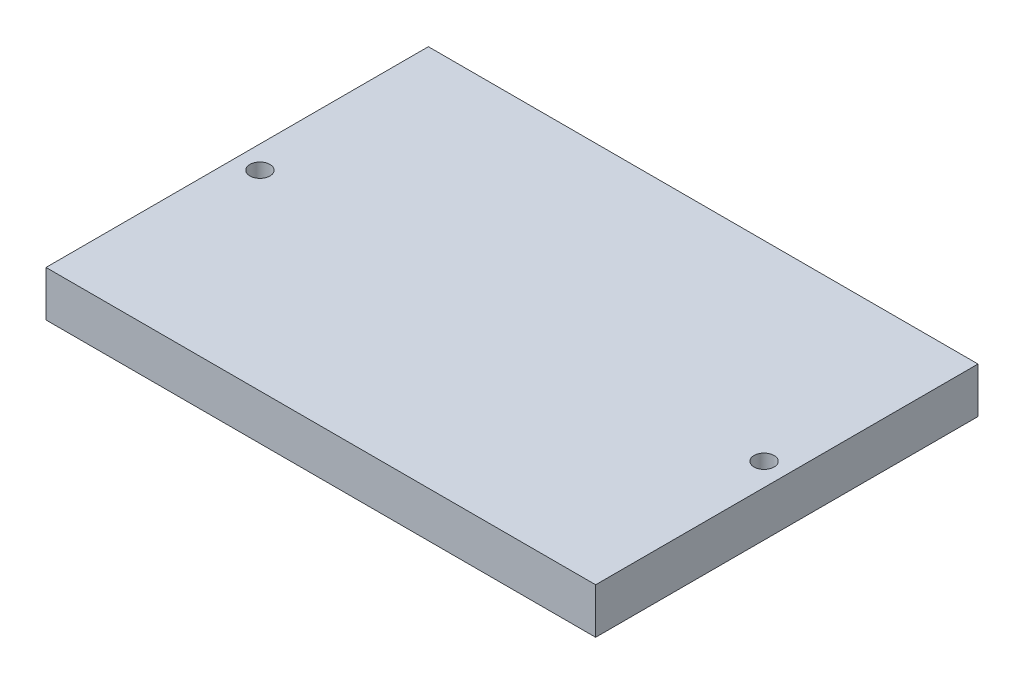
ISO-10303-21;
HEADER;
FILE_DESCRIPTION(('STEP AP214'),'2;1');
FILE_NAME('part.step','',(''),(''),'','','');
FILE_SCHEMA(('AUTOMOTIVE_DESIGN { 1 0 10303 214 1 1 1 1 }'));
ENDSEC;
DATA;
#1=APPLICATION_CONTEXT('core data for automotive mechanical design processes');
#2=APPLICATION_PROTOCOL_DEFINITION('international standard','automotive_design',2000,#1);
#3=PRODUCT_CONTEXT('',#1,'mechanical');
#4=PRODUCT('Part','Part','',(#3));
#5=PRODUCT_RELATED_PRODUCT_CATEGORY('part','',(#4));
#6=PRODUCT_DEFINITION_FORMATION('','',#4);
#7=PRODUCT_DEFINITION_CONTEXT('part definition',#1,'design');
#8=PRODUCT_DEFINITION('design','',#6,#7);
#9=PRODUCT_DEFINITION_SHAPE('','',#8);
#10=(LENGTH_UNIT() NAMED_UNIT(*) SI_UNIT(.MILLI.,.METRE.));
#11=(NAMED_UNIT(*) PLANE_ANGLE_UNIT() SI_UNIT($,.RADIAN.));
#12=(NAMED_UNIT(*) SI_UNIT($,.STERADIAN.) SOLID_ANGLE_UNIT());
#13=UNCERTAINTY_MEASURE_WITH_UNIT(LENGTH_MEASURE(1.E-05),#10,'distance_accuracy_value','');
#14=(GEOMETRIC_REPRESENTATION_CONTEXT(3) GLOBAL_UNCERTAINTY_ASSIGNED_CONTEXT((#13)) GLOBAL_UNIT_ASSIGNED_CONTEXT((#10,
#11,#12)) REPRESENTATION_CONTEXT('',''));
#15=CARTESIAN_POINT('',(0.,0.,0.));
#16=DIRECTION('',(0.,0.,1.));
#17=DIRECTION('',(1.,0.,0.));
#18=AXIS2_PLACEMENT_3D('',#15,#16,#17);
#19=CARTESIAN_POINT('',(47.975000062,140.175,30.475));
#20=DIRECTION('',(0.,-1.,0.));
#21=DIRECTION('',(0.,0.,-1.));
#22=AXIS2_PLACEMENT_3D('',#19,#20,#21);
#23=PLANE('',#22);
#24=DIRECTION('',(0.,0.,1.));
#25=VECTOR('',#24,1.);
#26=CARTESIAN_POINT('',(-57.500000062,140.175,-2.99510850149121E-13));
#27=LINE('',#26,#25);
#28=CARTESIAN_POINT('',(-57.500000062,140.175,-40.));
#29=VERTEX_POINT('',#28);
#30=CARTESIAN_POINT('',(-57.500000062,140.175,40.));
#31=VERTEX_POINT('',#30);
#32=EDGE_CURVE('E104',#29,#31,#27,.T.);
#33=ORIENTED_EDGE('',*,*,#32,.F.);
#34=DIRECTION('',(1.,0.,0.));
#35=VECTOR('',#34,1.);
#36=CARTESIAN_POINT('',(-57.500000062,140.175,-40.));
#37=LINE('',#36,#35);
#38=CARTESIAN_POINT('',(57.500000062,140.175,-40.));
#39=VERTEX_POINT('',#38);
#40=EDGE_CURVE('E110',#29,#39,#37,.T.);
#41=ORIENTED_EDGE('',*,*,#40,.T.);
#42=DIRECTION('',(0.,0.,-1.));
#43=VECTOR('',#42,1.);
#44=CARTESIAN_POINT('',(57.500000062,140.175,40.));
#45=LINE('',#44,#43);
#46=CARTESIAN_POINT('',(57.500000062,140.175,40.));
#47=VERTEX_POINT('',#46);
#48=EDGE_CURVE('E109',#47,#39,#45,.T.);
#49=ORIENTED_EDGE('',*,*,#48,.F.);
#50=DIRECTION('',(-1.,0.,0.));
#51=VECTOR('',#50,1.);
#52=CARTESIAN_POINT('',(-57.500000062,140.175,40.));
#53=LINE('',#52,#51);
#54=EDGE_CURVE('E98',#47,#31,#53,.T.);
#55=ORIENTED_EDGE('',*,*,#54,.T.);
#56=EDGE_LOOP('',(#33,#41,#49,#55));
#57=FACE_BOUND('',#56,.T.);
#58=ADVANCED_FACE('F45',(#57),#23,.T.);
#59=CARTESIAN_POINT('',(52.737500062,143.82,0.));
#60=DIRECTION('',(0.,1.,0.));
#61=DIRECTION('',(0.,0.,1.));
#62=AXIS2_PLACEMENT_3D('',#59,#60,#61);
#63=CONICAL_SURFACE('',#62,2.09999999999998,1.02974425867664);
#64=CARTESIAN_POINT('',(52.737500062,142.558192700042,0.));
#65=VERTEX_POINT('',#64);
#66=VERTEX_LOOP('',#65);
#67=FACE_BOUND('',#66,.T.);
#68=CARTESIAN_POINT('',(52.737500062,143.82,0.));
#69=DIRECTION('',(0.,1.,0.));
#70=DIRECTION('',(0.,0.,1.));
#71=AXIS2_PLACEMENT_3D('',#68,#69,#70);
#72=CIRCLE('',#71,2.09999999999998);
#73=CARTESIAN_POINT('',(52.737500062,143.82,2.09999999999998));
#74=VERTEX_POINT('',#73);
#75=EDGE_CURVE('E122',#74,#74,#72,.T.);
#76=ORIENTED_EDGE('',*,*,#75,.T.);
#77=EDGE_LOOP('',(#76));
#78=FACE_BOUND('',#77,.T.);
#79=ADVANCED_FACE('F156',(#67,#78),#63,.F.);
#80=CARTESIAN_POINT('',(-52.737500062,143.82,0.));
#81=DIRECTION('',(0.,1.,0.));
#82=DIRECTION('',(0.,0.,1.));
#83=AXIS2_PLACEMENT_3D('',#80,#81,#82);
#84=CONICAL_SURFACE('',#83,2.09999999999998,1.02974425867664);
#85=CARTESIAN_POINT('',(-52.737500062,142.558192700042,0.));
#86=VERTEX_POINT('',#85);
#87=VERTEX_LOOP('',#86);
#88=FACE_BOUND('',#87,.T.);
#89=CARTESIAN_POINT('',(-52.737500062,143.82,0.));
#90=DIRECTION('',(0.,1.,0.));
#91=DIRECTION('',(0.,0.,1.));
#92=AXIS2_PLACEMENT_3D('',#89,#90,#91);
#93=CIRCLE('',#92,2.09999999999998);
#94=CARTESIAN_POINT('',(-52.737500062,143.82,2.09999999999998));
#95=VERTEX_POINT('',#94);
#96=EDGE_CURVE('E120',#95,#95,#93,.T.);
#97=ORIENTED_EDGE('',*,*,#96,.T.);
#98=EDGE_LOOP('',(#97));
#99=FACE_BOUND('',#98,.T.);
#100=ADVANCED_FACE('F147',(#88,#99),#84,.F.);
#101=CARTESIAN_POINT('',(52.737500062,199.7,0.));
#102=DIRECTION('',(0.,1.,0.));
#103=DIRECTION('',(0.,0.,1.));
#104=AXIS2_PLACEMENT_3D('',#101,#102,#103);
#105=CYLINDRICAL_SURFACE('',#104,2.09999999999999);
#106=ORIENTED_EDGE('',*,*,#75,.F.);
#107=EDGE_LOOP('',(#106));
#108=FACE_BOUND('',#107,.T.);
#109=CARTESIAN_POINT('',(52.737500062,149.7,0.));
#110=DIRECTION('',(0.,1.,0.));
#111=DIRECTION('',(0.,0.,1.));
#112=AXIS2_PLACEMENT_3D('',#109,#110,#111);
#113=CIRCLE('',#112,2.09999999999999);
#114=CARTESIAN_POINT('',(52.737500062,149.7,2.09999999999998));
#115=VERTEX_POINT('',#114);
#116=EDGE_CURVE('E11',#115,#115,#113,.F.);
#117=ORIENTED_EDGE('',*,*,#116,.F.);
#118=EDGE_LOOP('',(#117));
#119=FACE_BOUND('',#118,.T.);
#120=ADVANCED_FACE('F144',(#108,#119),#105,.F.);
#121=CARTESIAN_POINT('',(-52.737500062,199.7,0.));
#122=DIRECTION('',(0.,1.,0.));
#123=DIRECTION('',(0.,0.,1.));
#124=AXIS2_PLACEMENT_3D('',#121,#122,#123);
#125=CYLINDRICAL_SURFACE('',#124,2.09999999999999);
#126=ORIENTED_EDGE('',*,*,#96,.F.);
#127=EDGE_LOOP('',(#126));
#128=FACE_BOUND('',#127,.T.);
#129=CARTESIAN_POINT('',(-52.737500062,149.7,0.));
#130=DIRECTION('',(0.,1.,0.));
#131=DIRECTION('',(0.,0.,1.));
#132=AXIS2_PLACEMENT_3D('',#129,#130,#131);
#133=CIRCLE('',#132,2.09999999999999);
#134=CARTESIAN_POINT('',(-52.737500062,149.7,2.09999999999998));
#135=VERTEX_POINT('',#134);
#136=EDGE_CURVE('E54',#135,#135,#133,.F.);
#137=ORIENTED_EDGE('',*,*,#136,.F.);
#138=EDGE_LOOP('',(#137));
#139=FACE_BOUND('',#138,.T.);
#140=ADVANCED_FACE('F146',(#128,#139),#125,.F.);
#141=CARTESIAN_POINT('',(-57.500000062,16.3362552552198,-2.99510850149121E-13));
#142=DIRECTION('',(-1.,0.,0.));
#143=DIRECTION('',(0.,0.,1.));
#144=AXIS2_PLACEMENT_3D('',#141,#142,#143);
#145=PLANE('',#144);
#146=DIRECTION('',(0.,-1.,0.));
#147=VECTOR('',#146,1.);
#148=CARTESIAN_POINT('',(-57.500000062,149.7,-40.));
#149=LINE('',#148,#147);
#150=CARTESIAN_POINT('',(-57.500000062,149.7,-40.));
#151=VERTEX_POINT('',#150);
#152=EDGE_CURVE('E102',#151,#29,#149,.T.);
#153=ORIENTED_EDGE('',*,*,#152,.T.);
#154=ORIENTED_EDGE('',*,*,#32,.T.);
#155=DIRECTION('',(0.,-1.,0.));
#156=VECTOR('',#155,1.);
#157=CARTESIAN_POINT('',(-57.500000062,149.7,40.));
#158=LINE('',#157,#156);
#159=CARTESIAN_POINT('',(-57.500000062,149.7,40.));
#160=VERTEX_POINT('',#159);
#161=EDGE_CURVE('E49',#160,#31,#158,.T.);
#162=ORIENTED_EDGE('',*,*,#161,.F.);
#163=DIRECTION('',(0.,0.,1.));
#164=VECTOR('',#163,1.);
#165=CARTESIAN_POINT('',(-57.500000062,149.7,40.));
#166=LINE('',#165,#164);
#167=EDGE_CURVE('E62',#151,#160,#166,.T.);
#168=ORIENTED_EDGE('',*,*,#167,.F.);
#169=EDGE_LOOP('',(#153,#154,#162,#168));
#170=FACE_BOUND('',#169,.T.);
#171=ADVANCED_FACE('F105',(#170),#145,.T.);
#172=CARTESIAN_POINT('',(57.500000062,149.7,40.));
#173=DIRECTION('',(0.,1.,0.));
#174=DIRECTION('',(0.,0.,1.));
#175=AXIS2_PLACEMENT_3D('',#172,#173,#174);
#176=PLANE('',#175);
#177=ORIENTED_EDGE('',*,*,#136,.T.);
#178=EDGE_LOOP('',(#177));
#179=FACE_BOUND('',#178,.T.);
#180=ORIENTED_EDGE('',*,*,#167,.T.);
#181=DIRECTION('',(1.,0.,0.));
#182=VECTOR('',#181,1.);
#183=CARTESIAN_POINT('',(-57.500000062,149.7,40.));
#184=LINE('',#183,#182);
#185=CARTESIAN_POINT('',(57.500000062,149.7,40.));
#186=VERTEX_POINT('',#185);
#187=EDGE_CURVE('E100',#160,#186,#184,.T.);
#188=ORIENTED_EDGE('',*,*,#187,.T.);
#189=DIRECTION('',(0.,0.,-1.));
#190=VECTOR('',#189,1.);
#191=CARTESIAN_POINT('',(57.500000062,149.7,40.));
#192=LINE('',#191,#190);
#193=CARTESIAN_POINT('',(57.500000062,149.7,-40.));
#194=VERTEX_POINT('',#193);
#195=EDGE_CURVE('E119',#186,#194,#192,.T.);
#196=ORIENTED_EDGE('',*,*,#195,.T.);
#197=DIRECTION('',(-1.,0.,0.));
#198=VECTOR('',#197,1.);
#199=CARTESIAN_POINT('',(-57.500000062,149.7,-40.));
#200=LINE('',#199,#198);
#201=EDGE_CURVE('E67',#194,#151,#200,.T.);
#202=ORIENTED_EDGE('',*,*,#201,.T.);
#203=EDGE_LOOP('',(#180,#188,#196,#202));
#204=FACE_BOUND('',#203,.T.);
#205=ORIENTED_EDGE('',*,*,#116,.T.);
#206=EDGE_LOOP('',(#205));
#207=FACE_BOUND('',#206,.T.);
#208=ADVANCED_FACE('F137',(#179,#204,#207),#176,.T.);
#209=CARTESIAN_POINT('',(-57.500000062,149.7,-40.));
#210=DIRECTION('',(0.,0.,1.));
#211=DIRECTION('',(1.,0.,0.));
#212=AXIS2_PLACEMENT_3D('',#209,#210,#211);
#213=PLANE('',#212);
#214=ORIENTED_EDGE('',*,*,#40,.F.);
#215=ORIENTED_EDGE('',*,*,#152,.F.);
#216=ORIENTED_EDGE('',*,*,#201,.F.);
#217=DIRECTION('',(0.,-1.,0.));
#218=VECTOR('',#217,1.);
#219=CARTESIAN_POINT('',(57.500000062,149.7,-40.));
#220=LINE('',#219,#218);
#221=EDGE_CURVE('E117',#194,#39,#220,.T.);
#222=ORIENTED_EDGE('',*,*,#221,.T.);
#223=EDGE_LOOP('',(#214,#215,#216,#222));
#224=FACE_BOUND('',#223,.T.);
#225=ADVANCED_FACE('F136',(#224),#213,.F.);
#226=CARTESIAN_POINT('',(-57.500000062,149.7,40.));
#227=DIRECTION('',(0.,0.,-1.));
#228=DIRECTION('',(-1.,0.,0.));
#229=AXIS2_PLACEMENT_3D('',#226,#227,#228);
#230=PLANE('',#229);
#231=ORIENTED_EDGE('',*,*,#54,.F.);
#232=DIRECTION('',(0.,-1.,0.));
#233=VECTOR('',#232,1.);
#234=CARTESIAN_POINT('',(57.500000062,149.7,40.));
#235=LINE('',#234,#233);
#236=EDGE_CURVE('E115',#186,#47,#235,.T.);
#237=ORIENTED_EDGE('',*,*,#236,.F.);
#238=ORIENTED_EDGE('',*,*,#187,.F.);
#239=ORIENTED_EDGE('',*,*,#161,.T.);
#240=EDGE_LOOP('',(#231,#237,#238,#239));
#241=FACE_BOUND('',#240,.T.);
#242=ADVANCED_FACE('F95',(#241),#230,.F.);
#243=CARTESIAN_POINT('',(57.500000062,56.813409305375,40.));
#244=DIRECTION('',(1.,0.,0.));
#245=DIRECTION('',(0.,0.,-1.));
#246=AXIS2_PLACEMENT_3D('',#243,#244,#245);
#247=PLANE('',#246);
#248=ORIENTED_EDGE('',*,*,#236,.T.);
#249=ORIENTED_EDGE('',*,*,#48,.T.);
#250=ORIENTED_EDGE('',*,*,#221,.F.);
#251=ORIENTED_EDGE('',*,*,#195,.F.);
#252=EDGE_LOOP('',(#248,#249,#250,#251));
#253=FACE_BOUND('',#252,.T.);
#254=ADVANCED_FACE('F47',(#253),#247,.T.);
#255=CLOSED_SHELL('',(#58,#79,#100,#120,#140,#171,#208,#225,#242,#254));
#256=MANIFOLD_SOLID_BREP('B2',#255);
#257=ADVANCED_BREP_SHAPE_REPRESENTATION('',(#18,#256),#14);
#258=SHAPE_DEFINITION_REPRESENTATION(#9,#257);
ENDSEC;
END-ISO-10303-21;
